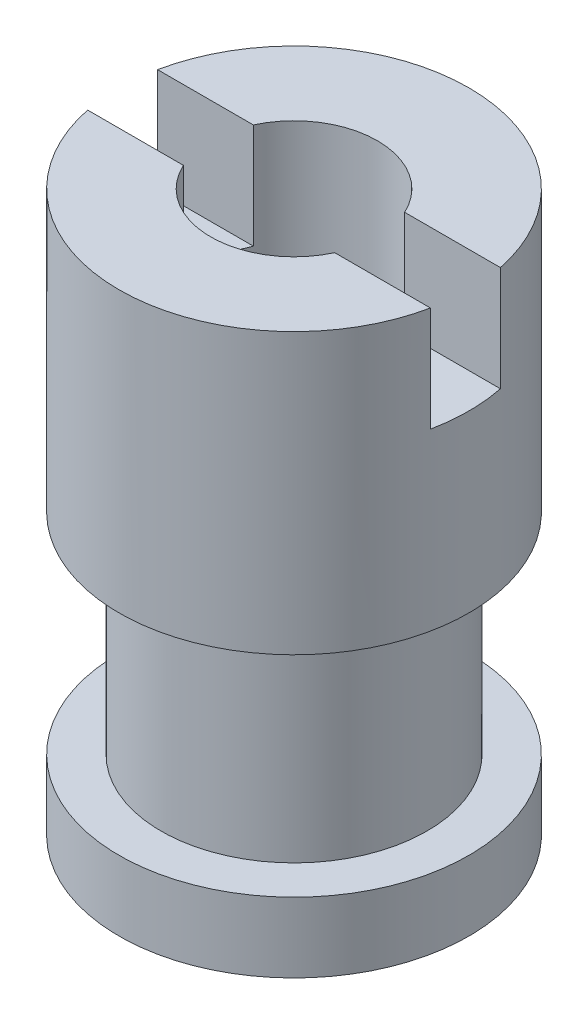
ISO-10303-21;
HEADER;
FILE_DESCRIPTION(('STEP AP214'),'2;1');
FILE_NAME('part.step','',(''),(''),'','','');
FILE_SCHEMA(('AUTOMOTIVE_DESIGN { 1 0 10303 214 1 1 1 1 }'));
ENDSEC;
DATA;
#1=APPLICATION_CONTEXT('core data for automotive mechanical design processes');
#2=APPLICATION_PROTOCOL_DEFINITION('international standard','automotive_design',2000,#1);
#3=PRODUCT_CONTEXT('',#1,'mechanical');
#4=PRODUCT('Part','Part','',(#3));
#5=PRODUCT_RELATED_PRODUCT_CATEGORY('part','',(#4));
#6=PRODUCT_DEFINITION_FORMATION('','',#4);
#7=PRODUCT_DEFINITION_CONTEXT('part definition',#1,'design');
#8=PRODUCT_DEFINITION('design','',#6,#7);
#9=PRODUCT_DEFINITION_SHAPE('','',#8);
#10=(LENGTH_UNIT() NAMED_UNIT(*) SI_UNIT(.MILLI.,.METRE.));
#11=(NAMED_UNIT(*) PLANE_ANGLE_UNIT() SI_UNIT($,.RADIAN.));
#12=(NAMED_UNIT(*) SI_UNIT($,.STERADIAN.) SOLID_ANGLE_UNIT());
#13=UNCERTAINTY_MEASURE_WITH_UNIT(LENGTH_MEASURE(1.E-05),#10,'distance_accuracy_value','');
#14=(GEOMETRIC_REPRESENTATION_CONTEXT(3) GLOBAL_UNCERTAINTY_ASSIGNED_CONTEXT((#13)) GLOBAL_UNIT_ASSIGNED_CONTEXT((#10,
#11,#12)) REPRESENTATION_CONTEXT('',''));
#15=CARTESIAN_POINT('',(0.,0.,0.));
#16=DIRECTION('',(0.,0.,1.));
#17=DIRECTION('',(1.,0.,0.));
#18=AXIS2_PLACEMENT_3D('',#15,#16,#17);
#19=CARTESIAN_POINT('',(0.,3.25,0.25));
#20=DIRECTION('',(0.,0.,1.));
#21=DIRECTION('',(1.,0.,0.));
#22=AXIS2_PLACEMENT_3D('',#19,#20,#21);
#23=PLANE('',#22);
#24=DIRECTION('',(1.,0.,0.));
#25=VECTOR('',#24,1.);
#26=CARTESIAN_POINT('',(0.,4.,0.25));
#27=LINE('',#26,#25);
#28=CARTESIAN_POINT('',(-1.22474487139159,4.,0.25));
#29=VERTEX_POINT('',#28);
#30=CARTESIAN_POINT('',(-0.540624728346753,4.,0.25));
#31=VERTEX_POINT('',#30);
#32=EDGE_CURVE('E122',#29,#31,#27,.T.);
#33=ORIENTED_EDGE('',*,*,#32,.T.);
#34=DIRECTION('',(0.,-1.,0.));
#35=VECTOR('',#34,1.);
#36=CARTESIAN_POINT('',(-0.540624728346753,4.,0.25));
#37=LINE('',#36,#35);
#38=CARTESIAN_POINT('',(-0.540624728346753,3.25,0.25));
#39=VERTEX_POINT('',#38);
#40=EDGE_CURVE('E105',#31,#39,#37,.T.);
#41=ORIENTED_EDGE('',*,*,#40,.T.);
#42=DIRECTION('',(1.,0.,0.));
#43=VECTOR('',#42,1.);
#44=CARTESIAN_POINT('',(1.5,3.25,0.25));
#45=LINE('',#44,#43);
#46=CARTESIAN_POINT('',(-1.22474487139159,3.25,0.25));
#47=VERTEX_POINT('',#46);
#48=EDGE_CURVE('E165',#47,#39,#45,.T.);
#49=ORIENTED_EDGE('',*,*,#48,.F.);
#50=DIRECTION('',(0.,-1.,0.));
#51=VECTOR('',#50,1.);
#52=CARTESIAN_POINT('',(-1.22474487139159,0.,0.25));
#53=LINE('',#52,#51);
#54=EDGE_CURVE('E155',#47,#29,#53,.F.);
#55=ORIENTED_EDGE('',*,*,#54,.T.);
#56=EDGE_LOOP('',(#33,#41,#49,#55));
#57=FACE_BOUND('',#56,.T.);
#58=ADVANCED_FACE('F33',(#57),#23,.F.);
#59=CARTESIAN_POINT('',(-1.5,3.25,-0.25));
#60=DIRECTION('',(0.,0.,-1.));
#61=DIRECTION('',(-1.,0.,0.));
#62=AXIS2_PLACEMENT_3D('',#59,#60,#61);
#63=PLANE('',#62);
#64=DIRECTION('',(-1.,0.,0.));
#65=VECTOR('',#64,1.);
#66=CARTESIAN_POINT('',(-1.5,4.,-0.25));
#67=LINE('',#66,#65);
#68=CARTESIAN_POINT('',(1.22474487139159,4.,-0.25));
#69=VERTEX_POINT('',#68);
#70=CARTESIAN_POINT('',(0.540624728346753,4.,-0.25));
#71=VERTEX_POINT('',#70);
#72=EDGE_CURVE('E111',#69,#71,#67,.T.);
#73=ORIENTED_EDGE('',*,*,#72,.T.);
#74=DIRECTION('',(0.,-1.,0.));
#75=VECTOR('',#74,1.);
#76=CARTESIAN_POINT('',(0.540624728346753,4.,-0.25));
#77=LINE('',#76,#75);
#78=CARTESIAN_POINT('',(0.540624728346753,3.25,-0.25));
#79=VERTEX_POINT('',#78);
#80=EDGE_CURVE('E96',#71,#79,#77,.T.);
#81=ORIENTED_EDGE('',*,*,#80,.T.);
#82=DIRECTION('',(-1.,0.,0.));
#83=VECTOR('',#82,1.);
#84=CARTESIAN_POINT('',(-1.5,3.25,-0.25));
#85=LINE('',#84,#83);
#86=CARTESIAN_POINT('',(1.22474487139159,3.25,-0.25));
#87=VERTEX_POINT('',#86);
#88=EDGE_CURVE('E125',#87,#79,#85,.T.);
#89=ORIENTED_EDGE('',*,*,#88,.F.);
#90=DIRECTION('',(0.,-1.,0.));
#91=VECTOR('',#90,1.);
#92=CARTESIAN_POINT('',(1.22474487139159,0.,-0.25));
#93=LINE('',#92,#91);
#94=EDGE_CURVE('E119',#87,#69,#93,.F.);
#95=ORIENTED_EDGE('',*,*,#94,.T.);
#96=EDGE_LOOP('',(#73,#81,#89,#95));
#97=FACE_BOUND('',#96,.T.);
#98=ADVANCED_FACE('F117',(#97),#63,.F.);
#99=CARTESIAN_POINT('',(-1.5,3.25,0.25));
#100=DIRECTION('',(0.,-1.,0.));
#101=DIRECTION('',(0.,0.,-1.));
#102=AXIS2_PLACEMENT_3D('',#99,#100,#101);
#103=PLANE('',#102);
#104=ORIENTED_EDGE('',*,*,#88,.T.);
#105=CARTESIAN_POINT('',(0.,3.25,0.));
#106=DIRECTION('',(0.,-1.,0.));
#107=DIRECTION('',(0.,0.,-1.));
#108=AXIS2_PLACEMENT_3D('',#105,#106,#107);
#109=CIRCLE('',#108,0.59563);
#110=CARTESIAN_POINT('',(0.540624728346753,3.25,0.25));
#111=VERTEX_POINT('',#110);
#112=EDGE_CURVE('E11',#79,#111,#109,.T.);
#113=ORIENTED_EDGE('',*,*,#112,.T.);
#114=CARTESIAN_POINT('',(1.22474487139159,3.25,0.25));
#115=VERTEX_POINT('',#114);
#116=EDGE_CURVE('E55',#111,#115,#45,.T.);
#117=ORIENTED_EDGE('',*,*,#116,.T.);
#118=CARTESIAN_POINT('',(0.,3.25,0.));
#119=DIRECTION('',(0.,-1.,0.));
#120=DIRECTION('',(0.,0.,-1.));
#121=AXIS2_PLACEMENT_3D('',#118,#119,#120);
#122=CIRCLE('',#121,1.25);
#123=EDGE_CURVE('E147',#115,#87,#122,.F.);
#124=ORIENTED_EDGE('',*,*,#123,.T.);
#125=EDGE_LOOP('',(#104,#113,#117,#124));
#126=FACE_BOUND('',#125,.T.);
#127=ADVANCED_FACE('F203',(#126),#103,.F.);
#128=CARTESIAN_POINT('',(0.,4.,0.));
#129=DIRECTION('',(0.,1.,0.));
#130=DIRECTION('',(0.,0.,1.));
#131=AXIS2_PLACEMENT_3D('',#128,#129,#130);
#132=PLANE('',#131);
#133=CARTESIAN_POINT('',(0.,4.,0.));
#134=DIRECTION('',(0.,-1.,0.));
#135=DIRECTION('',(0.,0.,-1.));
#136=AXIS2_PLACEMENT_3D('',#133,#134,#135);
#137=CIRCLE('',#136,0.59563);
#138=CARTESIAN_POINT('',(0.540624728346753,4.,0.25));
#139=VERTEX_POINT('',#138);
#140=EDGE_CURVE('E114',#139,#31,#137,.T.);
#141=ORIENTED_EDGE('',*,*,#140,.T.);
#142=ORIENTED_EDGE('',*,*,#32,.F.);
#143=CARTESIAN_POINT('',(0.,4.,0.));
#144=DIRECTION('',(0.,-1.,0.));
#145=DIRECTION('',(0.,0.,-1.));
#146=AXIS2_PLACEMENT_3D('',#143,#144,#145);
#147=CIRCLE('',#146,1.25);
#148=CARTESIAN_POINT('',(1.22474487139159,4.,0.25));
#149=VERTEX_POINT('',#148);
#150=EDGE_CURVE('E146',#149,#29,#147,.T.);
#151=ORIENTED_EDGE('',*,*,#150,.F.);
#152=EDGE_CURVE('E120',#139,#149,#27,.T.);
#153=ORIENTED_EDGE('',*,*,#152,.F.);
#154=EDGE_LOOP('',(#141,#142,#151,#153));
#155=FACE_BOUND('',#154,.T.);
#156=ADVANCED_FACE('F220',(#155),#132,.T.);
#157=CARTESIAN_POINT('',(-0.540624728346753,4.,-0.25));
#158=VERTEX_POINT('',#157);
#159=EDGE_CURVE('E99',#158,#71,#137,.T.);
#160=ORIENTED_EDGE('',*,*,#159,.T.);
#161=ORIENTED_EDGE('',*,*,#72,.F.);
#162=CARTESIAN_POINT('',(-1.22474487139159,4.,-0.25));
#163=VERTEX_POINT('',#162);
#164=EDGE_CURVE('E144',#163,#69,#147,.T.);
#165=ORIENTED_EDGE('',*,*,#164,.F.);
#166=EDGE_CURVE('E113',#158,#163,#67,.T.);
#167=ORIENTED_EDGE('',*,*,#166,.F.);
#168=EDGE_LOOP('',(#160,#161,#165,#167));
#169=FACE_BOUND('',#168,.T.);
#170=ADVANCED_FACE('F35',(#169),#132,.T.);
#171=CARTESIAN_POINT('',(0.,0.,0.));
#172=DIRECTION('',(0.,-1.,0.));
#173=DIRECTION('',(0.,0.,-1.));
#174=AXIS2_PLACEMENT_3D('',#171,#172,#173);
#175=CYLINDRICAL_SURFACE('',#174,1.25);
#176=ORIENTED_EDGE('',*,*,#54,.F.);
#177=CARTESIAN_POINT('',(-1.22474487139159,3.25,-0.25));
#178=VERTEX_POINT('',#177);
#179=EDGE_CURVE('E149',#178,#47,#122,.F.);
#180=ORIENTED_EDGE('',*,*,#179,.F.);
#181=DIRECTION('',(0.,-1.,0.));
#182=VECTOR('',#181,1.);
#183=CARTESIAN_POINT('',(-1.22474487139159,0.,-0.25));
#184=LINE('',#183,#182);
#185=EDGE_CURVE('E153',#163,#178,#184,.T.);
#186=ORIENTED_EDGE('',*,*,#185,.F.);
#187=ORIENTED_EDGE('',*,*,#164,.T.);
#188=ORIENTED_EDGE('',*,*,#94,.F.);
#189=ORIENTED_EDGE('',*,*,#123,.F.);
#190=DIRECTION('',(0.,-1.,0.));
#191=VECTOR('',#190,1.);
#192=CARTESIAN_POINT('',(1.22474487139159,0.,0.25));
#193=LINE('',#192,#191);
#194=EDGE_CURVE('E151',#149,#115,#193,.T.);
#195=ORIENTED_EDGE('',*,*,#194,.F.);
#196=ORIENTED_EDGE('',*,*,#150,.T.);
#197=EDGE_LOOP('',(#176,#180,#186,#187,#188,#189,#195,#196));
#198=FACE_BOUND('',#197,.T.);
#199=CARTESIAN_POINT('',(0.,2.,0.));
#200=DIRECTION('',(0.,-1.,0.));
#201=DIRECTION('',(0.,0.,-1.));
#202=AXIS2_PLACEMENT_3D('',#199,#200,#201);
#203=CIRCLE('',#202,1.25);
#204=CARTESIAN_POINT('',(0.,2.,-1.25));
#205=VERTEX_POINT('',#204);
#206=EDGE_CURVE('E141',#205,#205,#203,.T.);
#207=ORIENTED_EDGE('',*,*,#206,.F.);
#208=EDGE_LOOP('',(#207));
#209=FACE_BOUND('',#208,.T.);
#210=ADVANCED_FACE('F217',(#198,#209),#175,.T.);
#211=CARTESIAN_POINT('',(0.95,2.,0.));
#212=DIRECTION('',(0.,-1.,0.));
#213=DIRECTION('',(0.,0.,-1.));
#214=AXIS2_PLACEMENT_3D('',#211,#212,#213);
#215=PLANE('',#214);
#216=ORIENTED_EDGE('',*,*,#206,.T.);
#217=EDGE_LOOP('',(#216));
#218=FACE_BOUND('',#217,.T.);
#219=CARTESIAN_POINT('',(0.,2.,0.));
#220=DIRECTION('',(0.,-1.,0.));
#221=DIRECTION('',(0.,0.,-1.));
#222=AXIS2_PLACEMENT_3D('',#219,#220,#221);
#223=CIRCLE('',#222,0.95);
#224=CARTESIAN_POINT('',(0.,2.,-0.95));
#225=VERTEX_POINT('',#224);
#226=EDGE_CURVE('E138',#225,#225,#223,.T.);
#227=ORIENTED_EDGE('',*,*,#226,.F.);
#228=EDGE_LOOP('',(#227));
#229=FACE_BOUND('',#228,.T.);
#230=ADVANCED_FACE('F290',(#218,#229),#215,.T.);
#231=CARTESIAN_POINT('',(0.,0.,0.));
#232=DIRECTION('',(0.,-1.,0.));
#233=DIRECTION('',(0.,0.,-1.));
#234=AXIS2_PLACEMENT_3D('',#231,#232,#233);
#235=CYLINDRICAL_SURFACE('',#234,0.950000000000001);
#236=ORIENTED_EDGE('',*,*,#226,.T.);
#237=EDGE_LOOP('',(#236));
#238=FACE_BOUND('',#237,.T.);
#239=CARTESIAN_POINT('',(0.,0.5,0.));
#240=DIRECTION('',(0.,-1.,0.));
#241=DIRECTION('',(0.,0.,-1.));
#242=AXIS2_PLACEMENT_3D('',#239,#240,#241);
#243=CIRCLE('',#242,0.950000000000001);
#244=CARTESIAN_POINT('',(0.,0.5,-0.950000000000001));
#245=VERTEX_POINT('',#244);
#246=EDGE_CURVE('E135',#245,#245,#243,.T.);
#247=ORIENTED_EDGE('',*,*,#246,.F.);
#248=EDGE_LOOP('',(#247));
#249=FACE_BOUND('',#248,.T.);
#250=ADVANCED_FACE('F195',(#238,#249),#235,.T.);
#251=CARTESIAN_POINT('',(1.25,0.5,0.));
#252=DIRECTION('',(0.,1.,0.));
#253=DIRECTION('',(0.,0.,1.));
#254=AXIS2_PLACEMENT_3D('',#251,#252,#253);
#255=PLANE('',#254);
#256=ORIENTED_EDGE('',*,*,#246,.T.);
#257=EDGE_LOOP('',(#256));
#258=FACE_BOUND('',#257,.T.);
#259=CARTESIAN_POINT('',(0.,0.5,0.));
#260=DIRECTION('',(0.,-1.,0.));
#261=DIRECTION('',(0.,0.,-1.));
#262=AXIS2_PLACEMENT_3D('',#259,#260,#261);
#263=CIRCLE('',#262,1.25);
#264=CARTESIAN_POINT('',(0.,0.5,-1.25));
#265=VERTEX_POINT('',#264);
#266=EDGE_CURVE('E132',#265,#265,#263,.T.);
#267=ORIENTED_EDGE('',*,*,#266,.F.);
#268=EDGE_LOOP('',(#267));
#269=FACE_BOUND('',#268,.T.);
#270=ADVANCED_FACE('F189',(#258,#269),#255,.T.);
#271=CARTESIAN_POINT('',(0.,0.,0.));
#272=DIRECTION('',(0.,-1.,0.));
#273=DIRECTION('',(0.,0.,-1.));
#274=AXIS2_PLACEMENT_3D('',#271,#272,#273);
#275=CYLINDRICAL_SURFACE('',#274,1.25);
#276=ORIENTED_EDGE('',*,*,#266,.T.);
#277=EDGE_LOOP('',(#276));
#278=FACE_BOUND('',#277,.T.);
#279=CARTESIAN_POINT('',(0.,0.,0.));
#280=DIRECTION('',(0.,-1.,0.));
#281=DIRECTION('',(0.,0.,-1.));
#282=AXIS2_PLACEMENT_3D('',#279,#280,#281);
#283=CIRCLE('',#282,1.25);
#284=CARTESIAN_POINT('',(0.,0.,-1.25));
#285=VERTEX_POINT('',#284);
#286=EDGE_CURVE('E129',#285,#285,#283,.T.);
#287=ORIENTED_EDGE('',*,*,#286,.F.);
#288=EDGE_LOOP('',(#287));
#289=FACE_BOUND('',#288,.T.);
#290=ADVANCED_FACE('F184',(#278,#289),#275,.T.);
#291=CARTESIAN_POINT('',(0.,0.,0.));
#292=DIRECTION('',(0.,-1.,0.));
#293=DIRECTION('',(0.,0.,-1.));
#294=AXIS2_PLACEMENT_3D('',#291,#292,#293);
#295=PLANE('',#294);
#296=CARTESIAN_POINT('',(0.,0.,0.));
#297=DIRECTION('',(0.,-1.,0.));
#298=DIRECTION('',(0.,0.,-1.));
#299=AXIS2_PLACEMENT_3D('',#296,#297,#298);
#300=CIRCLE('',#299,0.59563);
#301=CARTESIAN_POINT('',(0.,0.,-0.59563));
#302=VERTEX_POINT('',#301);
#303=EDGE_CURVE('E115',#302,#302,#300,.T.);
#304=ORIENTED_EDGE('',*,*,#303,.F.);
#305=EDGE_LOOP('',(#304));
#306=FACE_BOUND('',#305,.T.);
#307=ORIENTED_EDGE('',*,*,#286,.T.);
#308=EDGE_LOOP('',(#307));
#309=FACE_BOUND('',#308,.T.);
#310=ADVANCED_FACE('F180',(#306,#309),#295,.T.);
#311=ORIENTED_EDGE('',*,*,#116,.F.);
#312=DIRECTION('',(0.,-1.,0.));
#313=VECTOR('',#312,1.);
#314=CARTESIAN_POINT('',(0.540624728346753,4.,0.25));
#315=LINE('',#314,#313);
#316=EDGE_CURVE('E104',#111,#139,#315,.F.);
#317=ORIENTED_EDGE('',*,*,#316,.T.);
#318=ORIENTED_EDGE('',*,*,#152,.T.);
#319=ORIENTED_EDGE('',*,*,#194,.T.);
#320=EDGE_LOOP('',(#311,#317,#318,#319));
#321=FACE_BOUND('',#320,.T.);
#322=ADVANCED_FACE('F183',(#321),#23,.F.);
#323=CARTESIAN_POINT('',(-0.540624728346753,3.25,-0.25));
#324=VERTEX_POINT('',#323);
#325=EDGE_CURVE('E164',#324,#178,#85,.T.);
#326=ORIENTED_EDGE('',*,*,#325,.F.);
#327=DIRECTION('',(0.,-1.,0.));
#328=VECTOR('',#327,1.);
#329=CARTESIAN_POINT('',(-0.540624728346753,4.,-0.25));
#330=LINE('',#329,#328);
#331=EDGE_CURVE('E48',#324,#158,#330,.F.);
#332=ORIENTED_EDGE('',*,*,#331,.T.);
#333=ORIENTED_EDGE('',*,*,#166,.T.);
#334=ORIENTED_EDGE('',*,*,#185,.T.);
#335=EDGE_LOOP('',(#326,#332,#333,#334));
#336=FACE_BOUND('',#335,.T.);
#337=ADVANCED_FACE('F168',(#336),#63,.F.);
#338=ORIENTED_EDGE('',*,*,#48,.T.);
#339=EDGE_CURVE('E37',#39,#324,#109,.T.);
#340=ORIENTED_EDGE('',*,*,#339,.T.);
#341=ORIENTED_EDGE('',*,*,#325,.T.);
#342=ORIENTED_EDGE('',*,*,#179,.T.);
#343=EDGE_LOOP('',(#338,#340,#341,#342));
#344=FACE_BOUND('',#343,.T.);
#345=ADVANCED_FACE('F163',(#344),#103,.F.);
#346=CARTESIAN_POINT('',(0.,4.,0.));
#347=DIRECTION('',(0.,-1.,0.));
#348=DIRECTION('',(0.,0.,-1.));
#349=AXIS2_PLACEMENT_3D('',#346,#347,#348);
#350=CYLINDRICAL_SURFACE('',#349,0.59563);
#351=ORIENTED_EDGE('',*,*,#303,.T.);
#352=EDGE_LOOP('',(#351));
#353=FACE_BOUND('',#352,.T.);
#354=ORIENTED_EDGE('',*,*,#112,.F.);
#355=ORIENTED_EDGE('',*,*,#80,.F.);
#356=ORIENTED_EDGE('',*,*,#159,.F.);
#357=ORIENTED_EDGE('',*,*,#331,.F.);
#358=ORIENTED_EDGE('',*,*,#339,.F.);
#359=ORIENTED_EDGE('',*,*,#40,.F.);
#360=ORIENTED_EDGE('',*,*,#140,.F.);
#361=ORIENTED_EDGE('',*,*,#316,.F.);
#362=EDGE_LOOP('',(#354,#355,#356,#357,#358,#359,#360,#361));
#363=FACE_BOUND('',#362,.T.);
#364=ADVANCED_FACE('F98',(#353,#363),#350,.F.);
#365=CLOSED_SHELL('',(#58,#98,#127,#156,#170,#210,#230,#250,#270,#290,#310,#322,#337,#345,#364));
#366=MANIFOLD_SOLID_BREP('B2',#365);
#367=ADVANCED_BREP_SHAPE_REPRESENTATION('',(#18,#366),#14);
#368=SHAPE_DEFINITION_REPRESENTATION(#9,#367);
ENDSEC;
END-ISO-10303-21;
